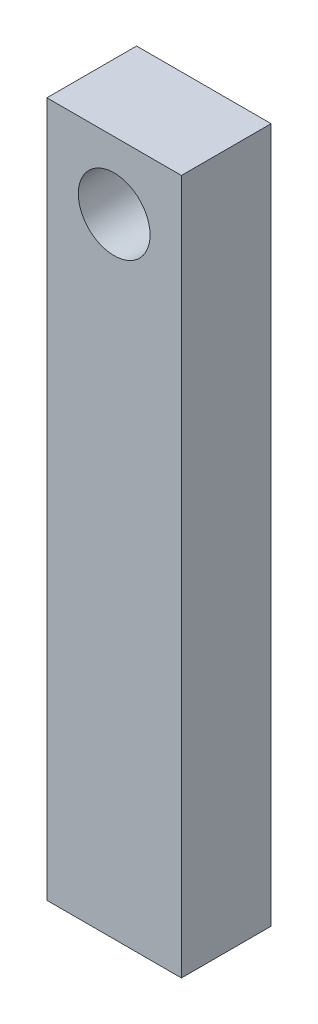
ISO-10303-21;
HEADER;
FILE_DESCRIPTION(('STEP AP214'),'2;1');
FILE_NAME('part.step','',(''),(''),'','','');
FILE_SCHEMA(('AUTOMOTIVE_DESIGN { 1 0 10303 214 1 1 1 1 }'));
ENDSEC;
DATA;
#1=APPLICATION_CONTEXT('core data for automotive mechanical design processes');
#2=APPLICATION_PROTOCOL_DEFINITION('international standard','automotive_design',2000,#1);
#3=PRODUCT_CONTEXT('',#1,'mechanical');
#4=PRODUCT('Part','Part','',(#3));
#5=PRODUCT_RELATED_PRODUCT_CATEGORY('part','',(#4));
#6=PRODUCT_DEFINITION_FORMATION('','',#4);
#7=PRODUCT_DEFINITION_CONTEXT('part definition',#1,'design');
#8=PRODUCT_DEFINITION('design','',#6,#7);
#9=PRODUCT_DEFINITION_SHAPE('','',#8);
#10=(LENGTH_UNIT() NAMED_UNIT(*) SI_UNIT(.MILLI.,.METRE.));
#11=(NAMED_UNIT(*) PLANE_ANGLE_UNIT() SI_UNIT($,.RADIAN.));
#12=(NAMED_UNIT(*) SI_UNIT($,.STERADIAN.) SOLID_ANGLE_UNIT());
#13=UNCERTAINTY_MEASURE_WITH_UNIT(LENGTH_MEASURE(1.E-05),#10,'distance_accuracy_value','');
#14=(GEOMETRIC_REPRESENTATION_CONTEXT(3) GLOBAL_UNCERTAINTY_ASSIGNED_CONTEXT((#13)) GLOBAL_UNIT_ASSIGNED_CONTEXT((#10,
#11,#12)) REPRESENTATION_CONTEXT('',''));
#15=CARTESIAN_POINT('',(0.,0.,0.));
#16=DIRECTION('',(0.,0.,1.));
#17=DIRECTION('',(1.,0.,0.));
#18=AXIS2_PLACEMENT_3D('',#15,#16,#17);
#19=CARTESIAN_POINT('',(0.,0.,10.));
#20=DIRECTION('',(0.,0.,-1.));
#21=DIRECTION('',(-1.,0.,0.));
#22=AXIS2_PLACEMENT_3D('',#19,#20,#21);
#23=PLANE('',#22);
#24=DIRECTION('',(0.,1.,0.));
#25=VECTOR('',#24,1.);
#26=CARTESIAN_POINT('',(7.5,-38.75,10.));
#27=LINE('',#26,#25);
#28=CARTESIAN_POINT('',(7.5,-38.75,10.));
#29=VERTEX_POINT('',#28);
#30=CARTESIAN_POINT('',(7.5,38.75,10.));
#31=VERTEX_POINT('',#30);
#32=EDGE_CURVE('E88',#29,#31,#27,.T.);
#33=ORIENTED_EDGE('',*,*,#32,.T.);
#34=DIRECTION('',(-1.,0.,0.));
#35=VECTOR('',#34,1.);
#36=CARTESIAN_POINT('',(-7.5,38.75,10.));
#37=LINE('',#36,#35);
#38=CARTESIAN_POINT('',(-7.5,38.75,10.));
#39=VERTEX_POINT('',#38);
#40=EDGE_CURVE('E83',#31,#39,#37,.T.);
#41=ORIENTED_EDGE('',*,*,#40,.T.);
#42=DIRECTION('',(0.,-1.,0.));
#43=VECTOR('',#42,1.);
#44=CARTESIAN_POINT('',(-7.5,-38.75,10.));
#45=LINE('',#44,#43);
#46=CARTESIAN_POINT('',(-7.5,-38.75,10.));
#47=VERTEX_POINT('',#46);
#48=EDGE_CURVE('E86',#39,#47,#45,.T.);
#49=ORIENTED_EDGE('',*,*,#48,.T.);
#50=DIRECTION('',(1.,0.,0.));
#51=VECTOR('',#50,1.);
#52=CARTESIAN_POINT('',(-7.5,-38.75,10.));
#53=LINE('',#52,#51);
#54=EDGE_CURVE('E53',#47,#29,#53,.T.);
#55=ORIENTED_EDGE('',*,*,#54,.T.);
#56=EDGE_LOOP('',(#33,#41,#49,#55));
#57=FACE_BOUND('',#56,.T.);
#58=CARTESIAN_POINT('',(0.,31.25,10.));
#59=DIRECTION('',(0.,0.,1.));
#60=DIRECTION('',(1.,0.,0.));
#61=AXIS2_PLACEMENT_3D('',#58,#59,#60);
#62=CIRCLE('',#61,4.);
#63=CARTESIAN_POINT('',(4.,31.25,10.));
#64=VERTEX_POINT('',#63);
#65=EDGE_CURVE('E103',#64,#64,#62,.T.);
#66=ORIENTED_EDGE('',*,*,#65,.F.);
#67=EDGE_LOOP('',(#66));
#68=FACE_BOUND('',#67,.T.);
#69=ADVANCED_FACE('F36',(#57,#68),#23,.F.);
#70=CARTESIAN_POINT('',(0.,0.,0.));
#71=DIRECTION('',(0.,0.,-1.));
#72=DIRECTION('',(-1.,0.,0.));
#73=AXIS2_PLACEMENT_3D('',#70,#71,#72);
#74=PLANE('',#73);
#75=DIRECTION('',(0.,1.,0.));
#76=VECTOR('',#75,1.);
#77=CARTESIAN_POINT('',(7.5,-38.75,0.));
#78=LINE('',#77,#76);
#79=CARTESIAN_POINT('',(7.5,-38.75,0.));
#80=VERTEX_POINT('',#79);
#81=CARTESIAN_POINT('',(7.5,38.75,0.));
#82=VERTEX_POINT('',#81);
#83=EDGE_CURVE('E100',#80,#82,#78,.T.);
#84=ORIENTED_EDGE('',*,*,#83,.F.);
#85=DIRECTION('',(1.,0.,0.));
#86=VECTOR('',#85,1.);
#87=CARTESIAN_POINT('',(-7.5,-38.75,0.));
#88=LINE('',#87,#86);
#89=CARTESIAN_POINT('',(-7.5,-38.75,0.));
#90=VERTEX_POINT('',#89);
#91=EDGE_CURVE('E76',#90,#80,#88,.T.);
#92=ORIENTED_EDGE('',*,*,#91,.F.);
#93=DIRECTION('',(0.,-1.,0.));
#94=VECTOR('',#93,1.);
#95=CARTESIAN_POINT('',(-7.5,-38.75,0.));
#96=LINE('',#95,#94);
#97=CARTESIAN_POINT('',(-7.5,38.75,0.));
#98=VERTEX_POINT('',#97);
#99=EDGE_CURVE('E70',#98,#90,#96,.T.);
#100=ORIENTED_EDGE('',*,*,#99,.F.);
#101=DIRECTION('',(-1.,0.,0.));
#102=VECTOR('',#101,1.);
#103=CARTESIAN_POINT('',(-7.5,38.75,0.));
#104=LINE('',#103,#102);
#105=EDGE_CURVE('E92',#82,#98,#104,.T.);
#106=ORIENTED_EDGE('',*,*,#105,.F.);
#107=EDGE_LOOP('',(#84,#92,#100,#106));
#108=FACE_BOUND('',#107,.T.);
#109=CARTESIAN_POINT('',(0.,31.25,0.));
#110=DIRECTION('',(0.,0.,1.));
#111=DIRECTION('',(1.,0.,0.));
#112=AXIS2_PLACEMENT_3D('',#109,#110,#111);
#113=CIRCLE('',#112,4.);
#114=CARTESIAN_POINT('',(4.,31.25,0.));
#115=VERTEX_POINT('',#114);
#116=EDGE_CURVE('E115',#115,#115,#113,.T.);
#117=ORIENTED_EDGE('',*,*,#116,.T.);
#118=EDGE_LOOP('',(#117));
#119=FACE_BOUND('',#118,.T.);
#120=ADVANCED_FACE('F111',(#108,#119),#74,.T.);
#121=CARTESIAN_POINT('',(7.5,-38.75,10.));
#122=DIRECTION('',(-1.,0.,0.));
#123=DIRECTION('',(0.,0.,1.));
#124=AXIS2_PLACEMENT_3D('',#121,#122,#123);
#125=PLANE('',#124);
#126=ORIENTED_EDGE('',*,*,#83,.T.);
#127=DIRECTION('',(0.,0.,-1.));
#128=VECTOR('',#127,1.);
#129=CARTESIAN_POINT('',(7.5,38.75,10.));
#130=LINE('',#129,#128);
#131=EDGE_CURVE('E11',#31,#82,#130,.T.);
#132=ORIENTED_EDGE('',*,*,#131,.F.);
#133=ORIENTED_EDGE('',*,*,#32,.F.);
#134=DIRECTION('',(0.,0.,-1.));
#135=VECTOR('',#134,1.);
#136=CARTESIAN_POINT('',(7.5,-38.75,10.));
#137=LINE('',#136,#135);
#138=EDGE_CURVE('E96',#29,#80,#137,.T.);
#139=ORIENTED_EDGE('',*,*,#138,.T.);
#140=EDGE_LOOP('',(#126,#132,#133,#139));
#141=FACE_BOUND('',#140,.T.);
#142=ADVANCED_FACE('F38',(#141),#125,.F.);
#143=CARTESIAN_POINT('',(-7.5,38.75,10.));
#144=DIRECTION('',(0.,-1.,0.));
#145=DIRECTION('',(0.,0.,-1.));
#146=AXIS2_PLACEMENT_3D('',#143,#144,#145);
#147=PLANE('',#146);
#148=ORIENTED_EDGE('',*,*,#105,.T.);
#149=DIRECTION('',(0.,0.,-1.));
#150=VECTOR('',#149,1.);
#151=CARTESIAN_POINT('',(-7.5,38.75,10.));
#152=LINE('',#151,#150);
#153=EDGE_CURVE('E45',#39,#98,#152,.T.);
#154=ORIENTED_EDGE('',*,*,#153,.F.);
#155=ORIENTED_EDGE('',*,*,#40,.F.);
#156=ORIENTED_EDGE('',*,*,#131,.T.);
#157=EDGE_LOOP('',(#148,#154,#155,#156));
#158=FACE_BOUND('',#157,.T.);
#159=ADVANCED_FACE('F91',(#158),#147,.F.);
#160=CARTESIAN_POINT('',(-7.5,-38.75,10.));
#161=DIRECTION('',(1.,0.,0.));
#162=DIRECTION('',(0.,0.,-1.));
#163=AXIS2_PLACEMENT_3D('',#160,#161,#162);
#164=PLANE('',#163);
#165=ORIENTED_EDGE('',*,*,#99,.T.);
#166=DIRECTION('',(0.,0.,-1.));
#167=VECTOR('',#166,1.);
#168=CARTESIAN_POINT('',(-7.5,-38.75,10.));
#169=LINE('',#168,#167);
#170=EDGE_CURVE('E93',#47,#90,#169,.T.);
#171=ORIENTED_EDGE('',*,*,#170,.F.);
#172=ORIENTED_EDGE('',*,*,#48,.F.);
#173=ORIENTED_EDGE('',*,*,#153,.T.);
#174=EDGE_LOOP('',(#165,#171,#172,#173));
#175=FACE_BOUND('',#174,.T.);
#176=ADVANCED_FACE('F94',(#175),#164,.F.);
#177=CARTESIAN_POINT('',(-7.5,-38.75,10.));
#178=DIRECTION('',(0.,1.,0.));
#179=DIRECTION('',(0.,0.,1.));
#180=AXIS2_PLACEMENT_3D('',#177,#178,#179);
#181=PLANE('',#180);
#182=ORIENTED_EDGE('',*,*,#91,.T.);
#183=ORIENTED_EDGE('',*,*,#138,.F.);
#184=ORIENTED_EDGE('',*,*,#54,.F.);
#185=ORIENTED_EDGE('',*,*,#170,.T.);
#186=EDGE_LOOP('',(#182,#183,#184,#185));
#187=FACE_BOUND('',#186,.T.);
#188=ADVANCED_FACE('F108',(#187),#181,.F.);
#189=CARTESIAN_POINT('',(0.,31.25,10.));
#190=DIRECTION('',(0.,0.,-1.));
#191=DIRECTION('',(-1.,0.,0.));
#192=AXIS2_PLACEMENT_3D('',#189,#190,#191);
#193=CYLINDRICAL_SURFACE('',#192,4.);
#194=ORIENTED_EDGE('',*,*,#65,.T.);
#195=EDGE_LOOP('',(#194));
#196=FACE_BOUND('',#195,.T.);
#197=ORIENTED_EDGE('',*,*,#116,.F.);
#198=EDGE_LOOP('',(#197));
#199=FACE_BOUND('',#198,.T.);
#200=ADVANCED_FACE('F121',(#196,#199),#193,.F.);
#201=CLOSED_SHELL('',(#69,#120,#142,#159,#176,#188,#200));
#202=MANIFOLD_SOLID_BREP('B2',#201);
#203=ADVANCED_BREP_SHAPE_REPRESENTATION('',(#18,#202),#14);
#204=SHAPE_DEFINITION_REPRESENTATION(#9,#203);
ENDSEC;
END-ISO-10303-21;
